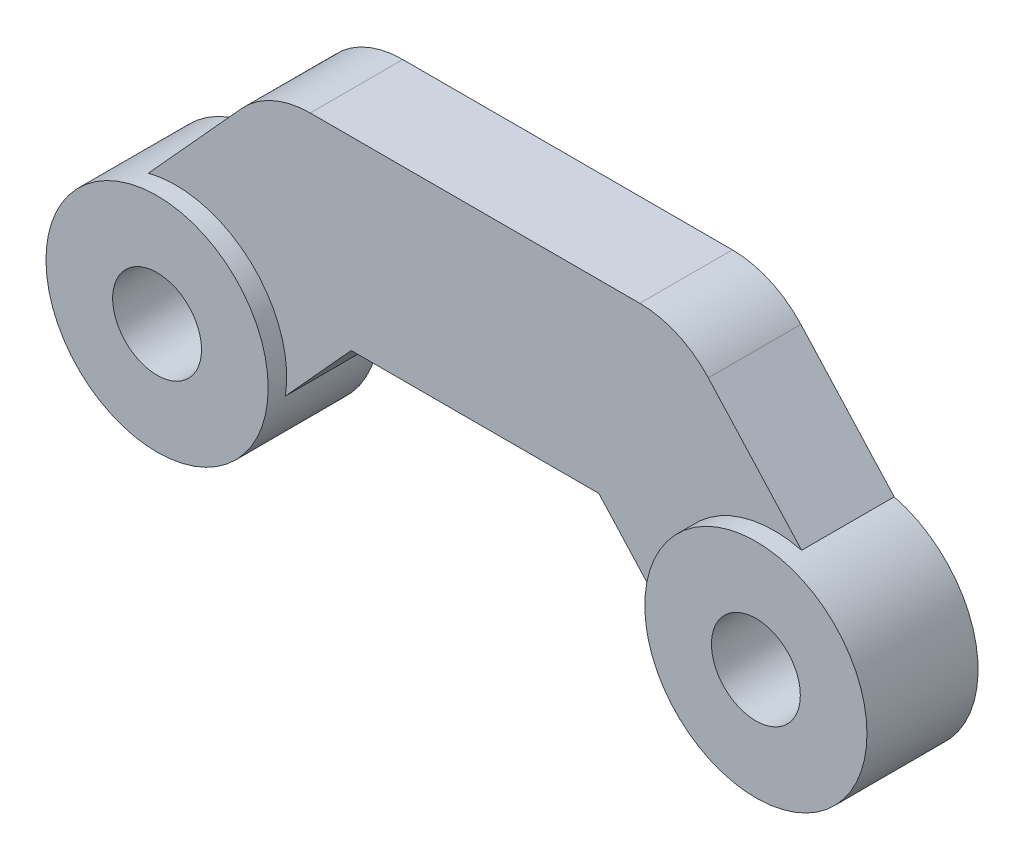
ISO-10303-21;
HEADER;
FILE_DESCRIPTION(('STEP AP214'),'2;1');
FILE_NAME('part.step','',(''),(''),'','','');
FILE_SCHEMA(('AUTOMOTIVE_DESIGN { 1 0 10303 214 1 1 1 1 }'));
ENDSEC;
DATA;
#1=APPLICATION_CONTEXT('core data for automotive mechanical design processes');
#2=APPLICATION_PROTOCOL_DEFINITION('international standard','automotive_design',2000,#1);
#3=PRODUCT_CONTEXT('',#1,'mechanical');
#4=PRODUCT('Part','Part','',(#3));
#5=PRODUCT_RELATED_PRODUCT_CATEGORY('part','',(#4));
#6=PRODUCT_DEFINITION_FORMATION('','',#4);
#7=PRODUCT_DEFINITION_CONTEXT('part definition',#1,'design');
#8=PRODUCT_DEFINITION('design','',#6,#7);
#9=PRODUCT_DEFINITION_SHAPE('','',#8);
#10=(LENGTH_UNIT() NAMED_UNIT(*) SI_UNIT(.MILLI.,.METRE.));
#11=(NAMED_UNIT(*) PLANE_ANGLE_UNIT() SI_UNIT($,.RADIAN.));
#12=(NAMED_UNIT(*) SI_UNIT($,.STERADIAN.) SOLID_ANGLE_UNIT());
#13=UNCERTAINTY_MEASURE_WITH_UNIT(LENGTH_MEASURE(1.E-05),#10,'distance_accuracy_value','');
#14=(GEOMETRIC_REPRESENTATION_CONTEXT(3) GLOBAL_UNCERTAINTY_ASSIGNED_CONTEXT((#13)) GLOBAL_UNIT_ASSIGNED_CONTEXT((#10,
#11,#12)) REPRESENTATION_CONTEXT('',''));
#15=CARTESIAN_POINT('',(0.,0.,0.));
#16=DIRECTION('',(0.,0.,1.));
#17=DIRECTION('',(1.,0.,0.));
#18=AXIS2_PLACEMENT_3D('',#15,#16,#17);
#19=CARTESIAN_POINT('',(0.,0.,1.25));
#20=DIRECTION('',(0.,0.,1.));
#21=DIRECTION('',(1.,0.,0.));
#22=AXIS2_PLACEMENT_3D('',#19,#20,#21);
#23=PLANE('',#22);
#24=DIRECTION('',(0.672522112138853,0.740077028885708,0.));
#25=VECTOR('',#24,1.);
#26=CARTESIAN_POINT('',(-6.27846033242681,5.70535665740243,1.25));
#27=LINE('',#26,#25);
#28=CARTESIAN_POINT('',(-8.81994081762332,2.90858419073458,1.25));
#29=VERTEX_POINT('',#28);
#30=CARTESIAN_POINT('',(-6.30031627750516,5.68130528034713,1.25));
#31=VERTEX_POINT('',#30);
#32=EDGE_CURVE('E176',#29,#31,#27,.T.);
#33=ORIENTED_EDGE('',*,*,#32,.F.);
#34=CARTESIAN_POINT('',(-8.085,0.,1.25));
#35=DIRECTION('',(0.,0.,1.));
#36=DIRECTION('',(1.,0.,0.));
#37=AXIS2_PLACEMENT_3D('',#34,#35,#36);
#38=CIRCLE('',#37,3.);
#39=CARTESIAN_POINT('',(-5.11955567319478,-0.454026369959677,1.25));
#40=VERTEX_POINT('',#39);
#41=EDGE_CURVE('E61',#29,#40,#38,.F.);
#42=ORIENTED_EDGE('',*,*,#41,.T.);
#43=DIRECTION('',(0.672522112138852,0.740077028885708,0.));
#44=VECTOR('',#43,1.);
#45=CARTESIAN_POINT('',(-2.57807518799827,2.34274609670816,1.25));
#46=LINE('',#45,#44);
#47=CARTESIAN_POINT('',(-3.34389464034406,1.5,1.25));
#48=VERTEX_POINT('',#47);
#49=EDGE_CURVE('E132',#40,#48,#46,.T.);
#50=ORIENTED_EDGE('',*,*,#49,.T.);
#51=DIRECTION('',(-1.,0.,0.));
#52=VECTOR('',#51,1.);
#53=CARTESIAN_POINT('',(0.,1.5,1.25));
#54=LINE('',#53,#52);
#55=CARTESIAN_POINT('',(3.34389464034405,1.5,1.25));
#56=VERTEX_POINT('',#55);
#57=EDGE_CURVE('E179',#56,#48,#54,.T.);
#58=ORIENTED_EDGE('',*,*,#57,.F.);
#59=DIRECTION('',(-0.672522112138852,0.740077028885708,0.));
#60=VECTOR('',#59,1.);
#61=CARTESIAN_POINT('',(2.57807518799827,2.34274609670816,1.25));
#62=LINE('',#61,#60);
#63=CARTESIAN_POINT('',(5.11955567320942,-0.454026369975778,1.25));
#64=VERTEX_POINT('',#63);
#65=EDGE_CURVE('E164',#64,#56,#62,.T.);
#66=ORIENTED_EDGE('',*,*,#65,.F.);
#67=CARTESIAN_POINT('',(8.08499999999452,5.13651621236733E-12,1.25));
#68=DIRECTION('',(0.,0.,1.));
#69=DIRECTION('',(1.,0.,0.));
#70=AXIS2_PLACEMENT_3D('',#67,#68,#69);
#71=CIRCLE('',#70,2.99999999998333);
#72=CARTESIAN_POINT('',(8.81994081763918,2.90858419071714,1.25));
#73=VERTEX_POINT('',#72);
#74=EDGE_CURVE('E155',#64,#73,#71,.F.);
#75=ORIENTED_EDGE('',*,*,#74,.T.);
#76=DIRECTION('',(-0.672522112138853,0.740077028885707,0.));
#77=VECTOR('',#76,1.);
#78=CARTESIAN_POINT('',(6.2784603324268,5.70535665740243,1.25));
#79=LINE('',#78,#77);
#80=CARTESIAN_POINT('',(6.30031627750516,5.68130528034713,1.25));
#81=VERTEX_POINT('',#80);
#82=EDGE_CURVE('E166',#73,#81,#79,.T.);
#83=ORIENTED_EDGE('',*,*,#82,.T.);
#84=CARTESIAN_POINT('',(4.45012370529089,4.,1.25));
#85=DIRECTION('',(0.,0.,1.));
#86=DIRECTION('',(1.,0.,0.));
#87=AXIS2_PLACEMENT_3D('',#84,#85,#86);
#88=CIRCLE('',#87,2.5);
#89=CARTESIAN_POINT('',(4.45012370529089,6.5,1.25));
#90=VERTEX_POINT('',#89);
#91=EDGE_CURVE('E169',#81,#90,#88,.T.);
#92=ORIENTED_EDGE('',*,*,#91,.T.);
#93=DIRECTION('',(-1.,0.,0.));
#94=VECTOR('',#93,1.);
#95=CARTESIAN_POINT('',(0.,6.5,1.25));
#96=LINE('',#95,#94);
#97=CARTESIAN_POINT('',(-4.45012370529089,6.5,1.25));
#98=VERTEX_POINT('',#97);
#99=EDGE_CURVE('E171',#90,#98,#96,.T.);
#100=ORIENTED_EDGE('',*,*,#99,.T.);
#101=CARTESIAN_POINT('',(-4.45012370529089,4.,1.25));
#102=DIRECTION('',(0.,0.,1.));
#103=DIRECTION('',(1.,0.,0.));
#104=AXIS2_PLACEMENT_3D('',#101,#102,#103);
#105=CIRCLE('',#104,2.5);
#106=EDGE_CURVE('E173',#98,#31,#105,.T.);
#107=ORIENTED_EDGE('',*,*,#106,.T.);
#108=EDGE_LOOP('',(#33,#42,#50,#58,#66,#75,#83,#92,#100,#107));
#109=FACE_BOUND('',#108,.T.);
#110=ADVANCED_FACE('F39',(#109),#23,.T.);
#111=CARTESIAN_POINT('',(-6.27846033242681,5.70535665740243,1.25));
#112=DIRECTION('',(-0.740077028885708,0.672522112138853,0.));
#113=DIRECTION('',(-0.672522112138853,-0.740077028885708,0.));
#114=AXIS2_PLACEMENT_3D('',#111,#112,#113);
#115=PLANE('',#114);
#116=DIRECTION('',(0.672522112138853,0.740077028885708,0.));
#117=VECTOR('',#116,1.);
#118=CARTESIAN_POINT('',(-6.27846033242681,5.70535665740243,-1.25));
#119=LINE('',#118,#117);
#120=CARTESIAN_POINT('',(-8.81994081762332,2.90858419073459,-1.25));
#121=VERTEX_POINT('',#120);
#122=CARTESIAN_POINT('',(-6.30031627750516,5.68130528034713,-1.25));
#123=VERTEX_POINT('',#122);
#124=EDGE_CURVE('E127',#121,#123,#119,.T.);
#125=ORIENTED_EDGE('',*,*,#124,.F.);
#126=DIRECTION('',(0.,0.,-1.));
#127=VECTOR('',#126,1.);
#128=CARTESIAN_POINT('',(-8.81994081762332,2.90858419073459,1.75));
#129=LINE('',#128,#127);
#130=EDGE_CURVE('E54',#121,#29,#129,.F.);
#131=ORIENTED_EDGE('',*,*,#130,.T.);
#132=ORIENTED_EDGE('',*,*,#32,.T.);
#133=DIRECTION('',(0.,0.,-1.));
#134=VECTOR('',#133,1.);
#135=CARTESIAN_POINT('',(-6.30031627750516,5.68130528034713,1.25));
#136=LINE('',#135,#134);
#137=EDGE_CURVE('E204',#31,#123,#136,.T.);
#138=ORIENTED_EDGE('',*,*,#137,.T.);
#139=EDGE_LOOP('',(#125,#131,#132,#138));
#140=FACE_BOUND('',#139,.T.);
#141=ADVANCED_FACE('F266',(#140),#115,.T.);
#142=CARTESIAN_POINT('',(-2.57807518799827,2.34274609670816,1.25));
#143=DIRECTION('',(-0.740077028885708,0.672522112138852,0.));
#144=DIRECTION('',(-0.672522112138852,-0.740077028885708,0.));
#145=AXIS2_PLACEMENT_3D('',#142,#143,#144);
#146=PLANE('',#145);
#147=DIRECTION('',(0.,0.,-1.));
#148=VECTOR('',#147,1.);
#149=CARTESIAN_POINT('',(-5.11955567319478,-0.454026369959676,1.75));
#150=LINE('',#149,#148);
#151=CARTESIAN_POINT('',(-5.11955567319478,-0.454026369959677,-1.25));
#152=VERTEX_POINT('',#151);
#153=EDGE_CURVE('E130',#152,#40,#150,.F.);
#154=ORIENTED_EDGE('',*,*,#153,.F.);
#155=DIRECTION('',(0.672522112138852,0.740077028885708,0.));
#156=VECTOR('',#155,1.);
#157=CARTESIAN_POINT('',(-2.57807518799827,2.34274609670816,-1.25));
#158=LINE('',#157,#156);
#159=CARTESIAN_POINT('',(-3.34389464034406,1.5,-1.25));
#160=VERTEX_POINT('',#159);
#161=EDGE_CURVE('E116',#152,#160,#158,.T.);
#162=ORIENTED_EDGE('',*,*,#161,.T.);
#163=DIRECTION('',(0.,0.,-1.));
#164=VECTOR('',#163,1.);
#165=CARTESIAN_POINT('',(-3.34389464034406,1.5,1.25));
#166=LINE('',#165,#164);
#167=EDGE_CURVE('E202',#48,#160,#166,.T.);
#168=ORIENTED_EDGE('',*,*,#167,.F.);
#169=ORIENTED_EDGE('',*,*,#49,.F.);
#170=EDGE_LOOP('',(#154,#162,#168,#169));
#171=FACE_BOUND('',#170,.T.);
#172=ADVANCED_FACE('F131',(#171),#146,.F.);
#173=CARTESIAN_POINT('',(2.57807518799827,2.34274609670816,1.25));
#174=DIRECTION('',(-0.740077028885708,-0.672522112138852,0.));
#175=DIRECTION('',(0.672522112138852,-0.740077028885708,0.));
#176=AXIS2_PLACEMENT_3D('',#173,#174,#175);
#177=PLANE('',#176);
#178=DIRECTION('',(-0.672522112138852,0.740077028885708,0.));
#179=VECTOR('',#178,1.);
#180=CARTESIAN_POINT('',(2.57807518799827,2.34274609670816,-1.25));
#181=LINE('',#180,#179);
#182=CARTESIAN_POINT('',(5.11955567320942,-0.454026369975778,-1.25));
#183=VERTEX_POINT('',#182);
#184=CARTESIAN_POINT('',(3.34389464034405,1.5,-1.25));
#185=VERTEX_POINT('',#184);
#186=EDGE_CURVE('E163',#183,#185,#181,.T.);
#187=ORIENTED_EDGE('',*,*,#186,.F.);
#188=DIRECTION('',(0.,0.,-1.));
#189=VECTOR('',#188,1.);
#190=CARTESIAN_POINT('',(5.11955567320942,-0.454026369975779,1.75));
#191=LINE('',#190,#189);
#192=EDGE_CURVE('E160',#183,#64,#191,.F.);
#193=ORIENTED_EDGE('',*,*,#192,.T.);
#194=ORIENTED_EDGE('',*,*,#65,.T.);
#195=DIRECTION('',(0.,0.,-1.));
#196=VECTOR('',#195,1.);
#197=CARTESIAN_POINT('',(3.34389464034405,1.5,1.25));
#198=LINE('',#197,#196);
#199=EDGE_CURVE('E182',#56,#185,#198,.T.);
#200=ORIENTED_EDGE('',*,*,#199,.T.);
#201=EDGE_LOOP('',(#187,#193,#194,#200));
#202=FACE_BOUND('',#201,.T.);
#203=ADVANCED_FACE('F41',(#202),#177,.T.);
#204=CARTESIAN_POINT('',(6.2784603324268,5.70535665740243,1.25));
#205=DIRECTION('',(-0.740077028885707,-0.672522112138853,0.));
#206=DIRECTION('',(0.672522112138853,-0.740077028885707,0.));
#207=AXIS2_PLACEMENT_3D('',#204,#205,#206);
#208=PLANE('',#207);
#209=DIRECTION('',(0.,0.,-1.));
#210=VECTOR('',#209,1.);
#211=CARTESIAN_POINT('',(8.81994081763918,2.90858419071714,1.75));
#212=LINE('',#211,#210);
#213=CARTESIAN_POINT('',(8.81994081763918,2.90858419071714,-1.25));
#214=VERTEX_POINT('',#213);
#215=EDGE_CURVE('E158',#214,#73,#212,.F.);
#216=ORIENTED_EDGE('',*,*,#215,.F.);
#217=DIRECTION('',(-0.672522112138853,0.740077028885707,0.));
#218=VECTOR('',#217,1.);
#219=CARTESIAN_POINT('',(6.2784603324268,5.70535665740243,-1.25));
#220=LINE('',#219,#218);
#221=CARTESIAN_POINT('',(6.30031627750516,5.68130528034713,-1.25));
#222=VERTEX_POINT('',#221);
#223=EDGE_CURVE('E184',#214,#222,#220,.T.);
#224=ORIENTED_EDGE('',*,*,#223,.T.);
#225=DIRECTION('',(0.,0.,-1.));
#226=VECTOR('',#225,1.);
#227=CARTESIAN_POINT('',(6.30031627750516,5.68130528034713,1.25));
#228=LINE('',#227,#226);
#229=EDGE_CURVE('E11',#81,#222,#228,.T.);
#230=ORIENTED_EDGE('',*,*,#229,.F.);
#231=ORIENTED_EDGE('',*,*,#82,.F.);
#232=EDGE_LOOP('',(#216,#224,#230,#231));
#233=FACE_BOUND('',#232,.T.);
#234=ADVANCED_FACE('F230',(#233),#208,.F.);
#235=CARTESIAN_POINT('',(4.45012370529089,4.,1.25));
#236=DIRECTION('',(0.,0.,-1.));
#237=DIRECTION('',(-1.,0.,0.));
#238=AXIS2_PLACEMENT_3D('',#235,#236,#237);
#239=CYLINDRICAL_SURFACE('',#238,2.5);
#240=CARTESIAN_POINT('',(4.45012370529089,4.,-1.25));
#241=DIRECTION('',(0.,0.,1.));
#242=DIRECTION('',(1.,0.,0.));
#243=AXIS2_PLACEMENT_3D('',#240,#241,#242);
#244=CIRCLE('',#243,2.5);
#245=CARTESIAN_POINT('',(4.45012370529089,6.5,-1.25));
#246=VERTEX_POINT('',#245);
#247=EDGE_CURVE('E186',#222,#246,#244,.T.);
#248=ORIENTED_EDGE('',*,*,#247,.T.);
#249=DIRECTION('',(0.,0.,-1.));
#250=VECTOR('',#249,1.);
#251=CARTESIAN_POINT('',(4.45012370529089,6.5,1.25));
#252=LINE('',#251,#250);
#253=EDGE_CURVE('E47',#90,#246,#252,.T.);
#254=ORIENTED_EDGE('',*,*,#253,.F.);
#255=ORIENTED_EDGE('',*,*,#91,.F.);
#256=ORIENTED_EDGE('',*,*,#229,.T.);
#257=EDGE_LOOP('',(#248,#254,#255,#256));
#258=FACE_BOUND('',#257,.T.);
#259=ADVANCED_FACE('F227',(#258),#239,.T.);
#260=CARTESIAN_POINT('',(0.,6.5,1.25));
#261=DIRECTION('',(0.,-1.,0.));
#262=DIRECTION('',(1.,0.,0.));
#263=AXIS2_PLACEMENT_3D('',#260,#261,#262);
#264=PLANE('',#263);
#265=DIRECTION('',(-1.,0.,0.));
#266=VECTOR('',#265,1.);
#267=CARTESIAN_POINT('',(0.,6.5,-1.25));
#268=LINE('',#267,#266);
#269=CARTESIAN_POINT('',(-4.45012370529089,6.5,-1.25));
#270=VERTEX_POINT('',#269);
#271=EDGE_CURVE('E188',#246,#270,#268,.T.);
#272=ORIENTED_EDGE('',*,*,#271,.T.);
#273=DIRECTION('',(0.,0.,-1.));
#274=VECTOR('',#273,1.);
#275=CARTESIAN_POINT('',(-4.45012370529089,6.5,1.25));
#276=LINE('',#275,#274);
#277=EDGE_CURVE('E207',#98,#270,#276,.T.);
#278=ORIENTED_EDGE('',*,*,#277,.F.);
#279=ORIENTED_EDGE('',*,*,#99,.F.);
#280=ORIENTED_EDGE('',*,*,#253,.T.);
#281=EDGE_LOOP('',(#272,#278,#279,#280));
#282=FACE_BOUND('',#281,.T.);
#283=ADVANCED_FACE('F214',(#282),#264,.F.);
#284=CARTESIAN_POINT('',(-4.45012370529089,4.,1.25));
#285=DIRECTION('',(0.,0.,-1.));
#286=DIRECTION('',(-1.,0.,0.));
#287=AXIS2_PLACEMENT_3D('',#284,#285,#286);
#288=CYLINDRICAL_SURFACE('',#287,2.5);
#289=CARTESIAN_POINT('',(-4.45012370529089,4.,-1.25));
#290=DIRECTION('',(0.,0.,1.));
#291=DIRECTION('',(1.,0.,0.));
#292=AXIS2_PLACEMENT_3D('',#289,#290,#291);
#293=CIRCLE('',#292,2.5);
#294=EDGE_CURVE('E190',#270,#123,#293,.T.);
#295=ORIENTED_EDGE('',*,*,#294,.T.);
#296=ORIENTED_EDGE('',*,*,#137,.F.);
#297=ORIENTED_EDGE('',*,*,#106,.F.);
#298=ORIENTED_EDGE('',*,*,#277,.T.);
#299=EDGE_LOOP('',(#295,#296,#297,#298));
#300=FACE_BOUND('',#299,.T.);
#301=ADVANCED_FACE('F223',(#300),#288,.T.);
#302=CARTESIAN_POINT('',(-8.085,0.,1.25));
#303=DIRECTION('',(0.,0.,-1.));
#304=DIRECTION('',(-1.,0.,0.));
#305=AXIS2_PLACEMENT_3D('',#302,#303,#304);
#306=CYLINDRICAL_SURFACE('',#305,1.2);
#307=CARTESIAN_POINT('',(-8.085,0.,-1.25));
#308=DIRECTION('',(0.,0.,1.));
#309=DIRECTION('',(1.,0.,0.));
#310=AXIS2_PLACEMENT_3D('',#307,#308,#309);
#311=CIRCLE('',#310,1.2);
#312=CARTESIAN_POINT('',(-6.885,0.,-1.25));
#313=VERTEX_POINT('',#312);
#314=EDGE_CURVE('E195',#313,#313,#311,.T.);
#315=ORIENTED_EDGE('',*,*,#314,.F.);
#316=EDGE_LOOP('',(#315));
#317=FACE_BOUND('',#316,.T.);
#318=CARTESIAN_POINT('',(-8.085,0.,1.75));
#319=DIRECTION('',(0.,0.,1.));
#320=DIRECTION('',(1.,0.,0.));
#321=AXIS2_PLACEMENT_3D('',#318,#319,#320);
#322=CIRCLE('',#321,1.2);
#323=CARTESIAN_POINT('',(-6.885,0.,1.75));
#324=VERTEX_POINT('',#323);
#325=EDGE_CURVE('E137',#324,#324,#322,.T.);
#326=ORIENTED_EDGE('',*,*,#325,.T.);
#327=EDGE_LOOP('',(#326));
#328=FACE_BOUND('',#327,.T.);
#329=ADVANCED_FACE('F261',(#317,#328),#306,.F.);
#330=CARTESIAN_POINT('',(0.,1.5,1.25));
#331=DIRECTION('',(0.,-1.,0.));
#332=DIRECTION('',(1.,0.,0.));
#333=AXIS2_PLACEMENT_3D('',#330,#331,#332);
#334=PLANE('',#333);
#335=DIRECTION('',(-1.,0.,0.));
#336=VECTOR('',#335,1.);
#337=CARTESIAN_POINT('',(0.,1.5,-1.25));
#338=LINE('',#337,#336);
#339=EDGE_CURVE('E123',#185,#160,#338,.T.);
#340=ORIENTED_EDGE('',*,*,#339,.F.);
#341=ORIENTED_EDGE('',*,*,#199,.F.);
#342=ORIENTED_EDGE('',*,*,#57,.T.);
#343=ORIENTED_EDGE('',*,*,#167,.T.);
#344=EDGE_LOOP('',(#340,#341,#342,#343));
#345=FACE_BOUND('',#344,.T.);
#346=ADVANCED_FACE('F238',(#345),#334,.T.);
#347=CARTESIAN_POINT('',(8.085,0.,1.25));
#348=DIRECTION('',(0.,0.,-1.));
#349=DIRECTION('',(-1.,0.,0.));
#350=AXIS2_PLACEMENT_3D('',#347,#348,#349);
#351=CYLINDRICAL_SURFACE('',#350,1.2);
#352=CARTESIAN_POINT('',(8.085,0.,-1.25));
#353=DIRECTION('',(0.,0.,1.));
#354=DIRECTION('',(1.,0.,0.));
#355=AXIS2_PLACEMENT_3D('',#352,#353,#354);
#356=CIRCLE('',#355,1.2);
#357=CARTESIAN_POINT('',(9.285,0.,-1.25));
#358=VERTEX_POINT('',#357);
#359=EDGE_CURVE('E167',#358,#358,#356,.T.);
#360=ORIENTED_EDGE('',*,*,#359,.F.);
#361=EDGE_LOOP('',(#360));
#362=FACE_BOUND('',#361,.T.);
#363=CARTESIAN_POINT('',(8.085,0.,1.75));
#364=DIRECTION('',(0.,0.,1.));
#365=DIRECTION('',(1.,0.,0.));
#366=AXIS2_PLACEMENT_3D('',#363,#364,#365);
#367=CIRCLE('',#366,1.2);
#368=CARTESIAN_POINT('',(9.285,0.,1.75));
#369=VERTEX_POINT('',#368);
#370=EDGE_CURVE('E149',#369,#369,#367,.T.);
#371=ORIENTED_EDGE('',*,*,#370,.T.);
#372=EDGE_LOOP('',(#371));
#373=FACE_BOUND('',#372,.T.);
#374=ADVANCED_FACE('F252',(#362,#373),#351,.F.);
#375=CARTESIAN_POINT('',(0.,0.,-1.25));
#376=DIRECTION('',(0.,0.,1.));
#377=DIRECTION('',(1.,0.,0.));
#378=AXIS2_PLACEMENT_3D('',#375,#376,#377);
#379=PLANE('',#378);
#380=CARTESIAN_POINT('',(-8.085,0.,-1.25));
#381=DIRECTION('',(0.,0.,1.));
#382=DIRECTION('',(1.,0.,0.));
#383=AXIS2_PLACEMENT_3D('',#380,#381,#382);
#384=CIRCLE('',#383,3.);
#385=EDGE_CURVE('E121',#152,#121,#384,.F.);
#386=ORIENTED_EDGE('',*,*,#385,.T.);
#387=ORIENTED_EDGE('',*,*,#124,.T.);
#388=ORIENTED_EDGE('',*,*,#294,.F.);
#389=ORIENTED_EDGE('',*,*,#271,.F.);
#390=ORIENTED_EDGE('',*,*,#247,.F.);
#391=ORIENTED_EDGE('',*,*,#223,.F.);
#392=CARTESIAN_POINT('',(8.08499999999452,5.13651621236733E-12,-1.25));
#393=DIRECTION('',(0.,0.,1.));
#394=DIRECTION('',(1.,0.,0.));
#395=AXIS2_PLACEMENT_3D('',#392,#393,#394);
#396=CIRCLE('',#395,2.99999999998333);
#397=EDGE_CURVE('E146',#214,#183,#396,.F.);
#398=ORIENTED_EDGE('',*,*,#397,.T.);
#399=ORIENTED_EDGE('',*,*,#186,.T.);
#400=ORIENTED_EDGE('',*,*,#339,.T.);
#401=ORIENTED_EDGE('',*,*,#161,.F.);
#402=EDGE_LOOP('',(#386,#387,#388,#389,#390,#391,#398,#399,#400,#401));
#403=FACE_BOUND('',#402,.T.);
#404=ORIENTED_EDGE('',*,*,#314,.T.);
#405=EDGE_LOOP('',(#404));
#406=FACE_BOUND('',#405,.T.);
#407=ORIENTED_EDGE('',*,*,#359,.T.);
#408=EDGE_LOOP('',(#407));
#409=FACE_BOUND('',#408,.T.);
#410=ADVANCED_FACE('F118',(#403,#406,#409),#379,.F.);
#411=CARTESIAN_POINT('',(8.08499999999452,5.13651621236733E-12,1.75));
#412=DIRECTION('',(0.,0.,1.));
#413=DIRECTION('',(1.,0.,0.));
#414=AXIS2_PLACEMENT_3D('',#411,#412,#413);
#415=PLANE('',#414);
#416=CARTESIAN_POINT('',(8.08499999999452,5.13651621236733E-12,1.75));
#417=DIRECTION('',(0.,0.,1.));
#418=DIRECTION('',(1.,0.,0.));
#419=AXIS2_PLACEMENT_3D('',#416,#417,#418);
#420=CIRCLE('',#419,2.99999999998333);
#421=CARTESIAN_POINT('',(11.0849999999779,5.13651621236733E-12,1.75));
#422=VERTEX_POINT('',#421);
#423=EDGE_CURVE('E152',#422,#422,#420,.T.);
#424=ORIENTED_EDGE('',*,*,#423,.T.);
#425=EDGE_LOOP('',(#424));
#426=FACE_BOUND('',#425,.T.);
#427=ORIENTED_EDGE('',*,*,#370,.F.);
#428=EDGE_LOOP('',(#427));
#429=FACE_BOUND('',#428,.T.);
#430=ADVANCED_FACE('F243',(#426,#429),#415,.T.);
#431=CARTESIAN_POINT('',(8.08499999999452,5.13651621236733E-12,1.75));
#432=DIRECTION('',(0.,0.,-1.));
#433=DIRECTION('',(-1.,0.,0.));
#434=AXIS2_PLACEMENT_3D('',#431,#432,#433);
#435=CYLINDRICAL_SURFACE('',#434,2.99999999998333);
#436=ORIENTED_EDGE('',*,*,#192,.F.);
#437=ORIENTED_EDGE('',*,*,#397,.F.);
#438=ORIENTED_EDGE('',*,*,#215,.T.);
#439=ORIENTED_EDGE('',*,*,#74,.F.);
#440=EDGE_LOOP('',(#436,#437,#438,#439));
#441=FACE_BOUND('',#440,.T.);
#442=ORIENTED_EDGE('',*,*,#423,.F.);
#443=EDGE_LOOP('',(#442));
#444=FACE_BOUND('',#443,.T.);
#445=ADVANCED_FACE('F239',(#441,#444),#435,.T.);
#446=CARTESIAN_POINT('',(-8.085,0.,1.75));
#447=DIRECTION('',(0.,0.,1.));
#448=DIRECTION('',(1.,0.,0.));
#449=AXIS2_PLACEMENT_3D('',#446,#447,#448);
#450=PLANE('',#449);
#451=CARTESIAN_POINT('',(-8.085,0.,1.75));
#452=DIRECTION('',(0.,0.,1.));
#453=DIRECTION('',(1.,0.,0.));
#454=AXIS2_PLACEMENT_3D('',#451,#452,#453);
#455=CIRCLE('',#454,3.);
#456=CARTESIAN_POINT('',(-5.085,0.,1.75));
#457=VERTEX_POINT('',#456);
#458=EDGE_CURVE('E140',#457,#457,#455,.T.);
#459=ORIENTED_EDGE('',*,*,#458,.T.);
#460=EDGE_LOOP('',(#459));
#461=FACE_BOUND('',#460,.T.);
#462=ORIENTED_EDGE('',*,*,#325,.F.);
#463=EDGE_LOOP('',(#462));
#464=FACE_BOUND('',#463,.T.);
#465=ADVANCED_FACE('F242',(#461,#464),#450,.T.);
#466=CARTESIAN_POINT('',(-8.085,0.,1.75));
#467=DIRECTION('',(0.,0.,-1.));
#468=DIRECTION('',(-1.,0.,0.));
#469=AXIS2_PLACEMENT_3D('',#466,#467,#468);
#470=CYLINDRICAL_SURFACE('',#469,3.);
#471=ORIENTED_EDGE('',*,*,#130,.F.);
#472=ORIENTED_EDGE('',*,*,#385,.F.);
#473=ORIENTED_EDGE('',*,*,#153,.T.);
#474=ORIENTED_EDGE('',*,*,#41,.F.);
#475=EDGE_LOOP('',(#471,#472,#473,#474));
#476=FACE_BOUND('',#475,.T.);
#477=ORIENTED_EDGE('',*,*,#458,.F.);
#478=EDGE_LOOP('',(#477));
#479=FACE_BOUND('',#478,.T.);
#480=ADVANCED_FACE('F135',(#476,#479),#470,.T.);
#481=CLOSED_SHELL('',(#110,#141,#172,#203,#234,#259,#283,#301,#329,#346,#374,#410,#430,#445,
#465,#480));
#482=MANIFOLD_SOLID_BREP('B2',#481);
#483=ADVANCED_BREP_SHAPE_REPRESENTATION('',(#18,#482),#14);
#484=SHAPE_DEFINITION_REPRESENTATION(#9,#483);
ENDSEC;
END-ISO-10303-21;
